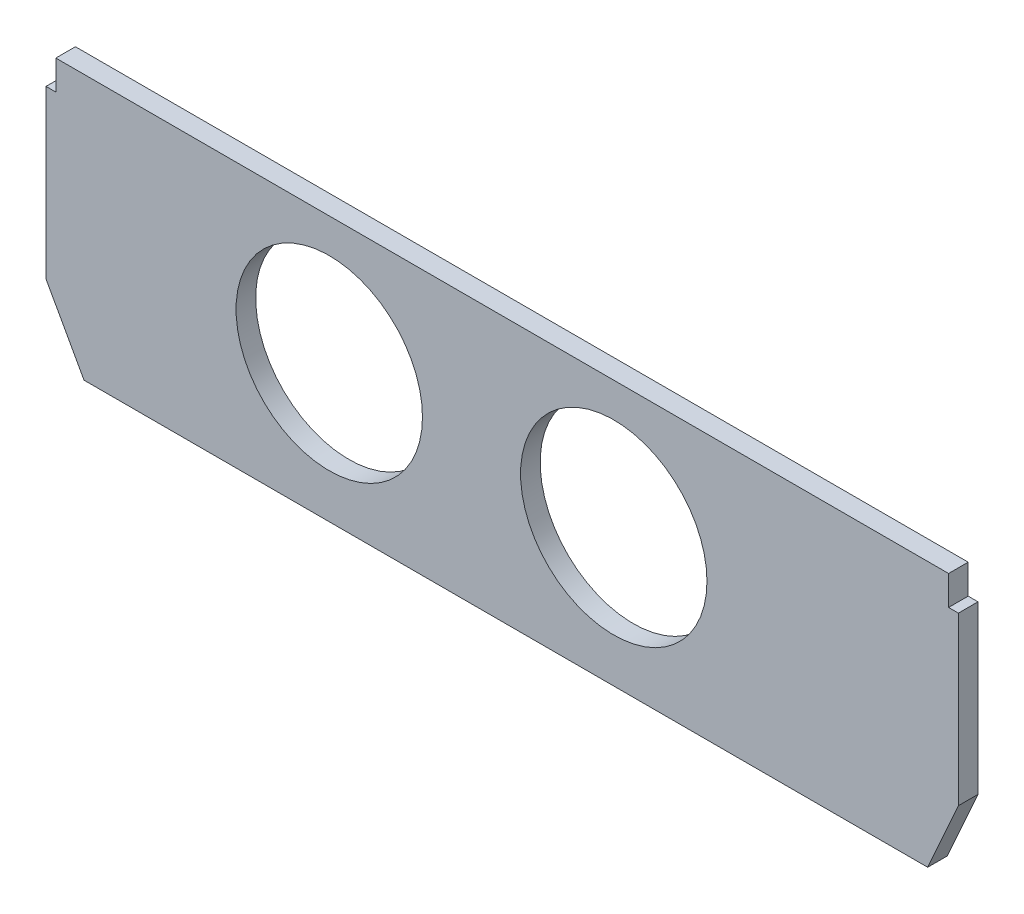
ISO-10303-21;
HEADER;
FILE_DESCRIPTION(('STEP AP214'),'2;1');
FILE_NAME('part.step','',(''),(''),'','','');
FILE_SCHEMA(('AUTOMOTIVE_DESIGN { 1 0 10303 214 1 1 1 1 }'));
ENDSEC;
DATA;
#1=APPLICATION_CONTEXT('core data for automotive mechanical design processes');
#2=APPLICATION_PROTOCOL_DEFINITION('international standard','automotive_design',2000,#1);
#3=PRODUCT_CONTEXT('',#1,'mechanical');
#4=PRODUCT('Part','Part','',(#3));
#5=PRODUCT_RELATED_PRODUCT_CATEGORY('part','',(#4));
#6=PRODUCT_DEFINITION_FORMATION('','',#4);
#7=PRODUCT_DEFINITION_CONTEXT('part definition',#1,'design');
#8=PRODUCT_DEFINITION('design','',#6,#7);
#9=PRODUCT_DEFINITION_SHAPE('','',#8);
#10=(LENGTH_UNIT() NAMED_UNIT(*) SI_UNIT(.MILLI.,.METRE.));
#11=(NAMED_UNIT(*) PLANE_ANGLE_UNIT() SI_UNIT($,.RADIAN.));
#12=(NAMED_UNIT(*) SI_UNIT($,.STERADIAN.) SOLID_ANGLE_UNIT());
#13=UNCERTAINTY_MEASURE_WITH_UNIT(LENGTH_MEASURE(1.E-05),#10,'distance_accuracy_value','');
#14=(GEOMETRIC_REPRESENTATION_CONTEXT(3) GLOBAL_UNCERTAINTY_ASSIGNED_CONTEXT((#13)) GLOBAL_UNIT_ASSIGNED_CONTEXT((#10,
#11,#12)) REPRESENTATION_CONTEXT('',''));
#15=CARTESIAN_POINT('',(0.,0.,0.));
#16=DIRECTION('',(0.,0.,1.));
#17=DIRECTION('',(1.,0.,0.));
#18=AXIS2_PLACEMENT_3D('',#15,#16,#17);
#19=CARTESIAN_POINT('',(10.635083268963,0.,10.));
#20=DIRECTION('',(-1.,0.,0.));
#21=DIRECTION('',(0.,-1.,0.));
#22=AXIS2_PLACEMENT_3D('',#19,#20,#21);
#23=PLANE('',#22);
#24=DIRECTION('',(0.,1.,0.));
#25=VECTOR('',#24,1.);
#26=CARTESIAN_POINT('',(10.635083268963,0.,0.));
#27=LINE('',#26,#25);
#28=CARTESIAN_POINT('',(10.635083268963,120.,0.));
#29=VERTEX_POINT('',#28);
#30=CARTESIAN_POINT('',(10.635083268963,135.,0.));
#31=VERTEX_POINT('',#30);
#32=EDGE_CURVE('E165',#29,#31,#27,.T.);
#33=ORIENTED_EDGE('',*,*,#32,.T.);
#34=DIRECTION('',(0.,0.,-1.));
#35=VECTOR('',#34,1.);
#36=CARTESIAN_POINT('',(10.635083268963,135.,10.));
#37=LINE('',#36,#35);
#38=CARTESIAN_POINT('',(10.635083268963,135.,10.));
#39=VERTEX_POINT('',#38);
#40=EDGE_CURVE('E11',#39,#31,#37,.T.);
#41=ORIENTED_EDGE('',*,*,#40,.F.);
#42=DIRECTION('',(0.,1.,0.));
#43=VECTOR('',#42,1.);
#44=CARTESIAN_POINT('',(10.635083268963,0.,10.));
#45=LINE('',#44,#43);
#46=CARTESIAN_POINT('',(10.635083268963,120.,10.));
#47=VERTEX_POINT('',#46);
#48=EDGE_CURVE('E207',#47,#39,#45,.T.);
#49=ORIENTED_EDGE('',*,*,#48,.F.);
#50=DIRECTION('',(0.,0.,-1.));
#51=VECTOR('',#50,1.);
#52=CARTESIAN_POINT('',(10.635083268963,120.,10.));
#53=LINE('',#52,#51);
#54=EDGE_CURVE('E164',#47,#29,#53,.T.);
#55=ORIENTED_EDGE('',*,*,#54,.T.);
#56=EDGE_LOOP('',(#33,#41,#49,#55));
#57=FACE_BOUND('',#56,.T.);
#58=ADVANCED_FACE('F43',(#57),#23,.F.);
#59=CARTESIAN_POINT('',(0.,135.,10.));
#60=DIRECTION('',(0.,-1.,0.));
#61=DIRECTION('',(1.,0.,0.));
#62=AXIS2_PLACEMENT_3D('',#59,#60,#61);
#63=PLANE('',#62);
#64=DIRECTION('',(-1.,0.,0.));
#65=VECTOR('',#64,1.);
#66=CARTESIAN_POINT('',(0.,135.,0.));
#67=LINE('',#66,#65);
#68=CARTESIAN_POINT('',(-444.364916731037,135.,0.));
#69=VERTEX_POINT('',#68);
#70=EDGE_CURVE('E169',#31,#69,#67,.T.);
#71=ORIENTED_EDGE('',*,*,#70,.T.);
#72=DIRECTION('',(0.,0.,-1.));
#73=VECTOR('',#72,1.);
#74=CARTESIAN_POINT('',(-444.364916731037,135.,10.));
#75=LINE('',#74,#73);
#76=CARTESIAN_POINT('',(-444.364916731037,135.,10.));
#77=VERTEX_POINT('',#76);
#78=EDGE_CURVE('E52',#77,#69,#75,.T.);
#79=ORIENTED_EDGE('',*,*,#78,.F.);
#80=DIRECTION('',(-1.,0.,0.));
#81=VECTOR('',#80,1.);
#82=CARTESIAN_POINT('',(0.,135.,10.));
#83=LINE('',#82,#81);
#84=EDGE_CURVE('E109',#39,#77,#83,.T.);
#85=ORIENTED_EDGE('',*,*,#84,.F.);
#86=ORIENTED_EDGE('',*,*,#40,.T.);
#87=EDGE_LOOP('',(#71,#79,#85,#86));
#88=FACE_BOUND('',#87,.T.);
#89=ADVANCED_FACE('F232',(#88),#63,.F.);
#90=CARTESIAN_POINT('',(-444.364916731037,0.,10.));
#91=DIRECTION('',(-1.,0.,0.));
#92=DIRECTION('',(0.,0.,1.));
#93=AXIS2_PLACEMENT_3D('',#90,#91,#92);
#94=PLANE('',#93);
#95=DIRECTION('',(0.,1.,0.));
#96=VECTOR('',#95,1.);
#97=CARTESIAN_POINT('',(-444.364916731037,0.,0.));
#98=LINE('',#97,#96);
#99=CARTESIAN_POINT('',(-444.364916731037,120.,0.));
#100=VERTEX_POINT('',#99);
#101=EDGE_CURVE('E173',#100,#69,#98,.T.);
#102=ORIENTED_EDGE('',*,*,#101,.F.);
#103=DIRECTION('',(0.,0.,-1.));
#104=VECTOR('',#103,1.);
#105=CARTESIAN_POINT('',(-444.364916731037,120.,10.));
#106=LINE('',#105,#104);
#107=CARTESIAN_POINT('',(-444.364916731037,120.,10.));
#108=VERTEX_POINT('',#107);
#109=EDGE_CURVE('E223',#108,#100,#106,.T.);
#110=ORIENTED_EDGE('',*,*,#109,.F.);
#111=DIRECTION('',(0.,1.,0.));
#112=VECTOR('',#111,1.);
#113=CARTESIAN_POINT('',(-444.364916731037,0.,10.));
#114=LINE('',#113,#112);
#115=EDGE_CURVE('E231',#108,#77,#114,.T.);
#116=ORIENTED_EDGE('',*,*,#115,.T.);
#117=ORIENTED_EDGE('',*,*,#78,.T.);
#118=EDGE_LOOP('',(#102,#110,#116,#117));
#119=FACE_BOUND('',#118,.T.);
#120=ADVANCED_FACE('F229',(#119),#94,.T.);
#121=CARTESIAN_POINT('',(0.,120.,10.));
#122=DIRECTION('',(0.,1.,0.));
#123=DIRECTION('',(0.,0.,1.));
#124=AXIS2_PLACEMENT_3D('',#121,#122,#123);
#125=PLANE('',#124);
#126=DIRECTION('',(1.,0.,0.));
#127=VECTOR('',#126,1.);
#128=CARTESIAN_POINT('',(0.,120.,0.));
#129=LINE('',#128,#127);
#130=CARTESIAN_POINT('',(-449.364916731037,120.,0.));
#131=VERTEX_POINT('',#130);
#132=EDGE_CURVE('E177',#131,#100,#129,.T.);
#133=ORIENTED_EDGE('',*,*,#132,.F.);
#134=DIRECTION('',(0.,0.,-1.));
#135=VECTOR('',#134,1.);
#136=CARTESIAN_POINT('',(-449.364916731037,120.,10.));
#137=LINE('',#136,#135);
#138=CARTESIAN_POINT('',(-449.364916731037,120.,10.));
#139=VERTEX_POINT('',#138);
#140=EDGE_CURVE('E220',#139,#131,#137,.T.);
#141=ORIENTED_EDGE('',*,*,#140,.F.);
#142=DIRECTION('',(1.,0.,0.));
#143=VECTOR('',#142,1.);
#144=CARTESIAN_POINT('',(0.,120.,10.));
#145=LINE('',#144,#143);
#146=EDGE_CURVE('E244',#139,#108,#145,.T.);
#147=ORIENTED_EDGE('',*,*,#146,.T.);
#148=ORIENTED_EDGE('',*,*,#109,.T.);
#149=EDGE_LOOP('',(#133,#141,#147,#148));
#150=FACE_BOUND('',#149,.T.);
#151=ADVANCED_FACE('F241',(#150),#125,.T.);
#152=CARTESIAN_POINT('',(-449.364916731037,0.,10.));
#153=DIRECTION('',(-1.,0.,0.));
#154=DIRECTION('',(0.,0.,1.));
#155=AXIS2_PLACEMENT_3D('',#152,#153,#154);
#156=PLANE('',#155);
#157=DIRECTION('',(0.,1.,0.));
#158=VECTOR('',#157,1.);
#159=CARTESIAN_POINT('',(-449.364916731037,0.,0.));
#160=LINE('',#159,#158);
#161=CARTESIAN_POINT('',(-449.364916731037,35.,0.));
#162=VERTEX_POINT('',#161);
#163=EDGE_CURVE('E181',#162,#131,#160,.T.);
#164=ORIENTED_EDGE('',*,*,#163,.F.);
#165=DIRECTION('',(0.,0.,-1.));
#166=VECTOR('',#165,1.);
#167=CARTESIAN_POINT('',(-449.364916731037,35.,10.));
#168=LINE('',#167,#166);
#169=CARTESIAN_POINT('',(-449.364916731037,35.,10.));
#170=VERTEX_POINT('',#169);
#171=EDGE_CURVE('E217',#170,#162,#168,.T.);
#172=ORIENTED_EDGE('',*,*,#171,.F.);
#173=DIRECTION('',(0.,1.,0.));
#174=VECTOR('',#173,1.);
#175=CARTESIAN_POINT('',(-449.364916731037,0.,10.));
#176=LINE('',#175,#174);
#177=EDGE_CURVE('E251',#170,#139,#176,.T.);
#178=ORIENTED_EDGE('',*,*,#177,.T.);
#179=ORIENTED_EDGE('',*,*,#140,.T.);
#180=EDGE_LOOP('',(#164,#172,#178,#179));
#181=FACE_BOUND('',#180,.T.);
#182=ADVANCED_FACE('F293',(#181),#156,.T.);
#183=CARTESIAN_POINT('',(-329.21875,-182.151248001318,10.));
#184=DIRECTION('',(-0.875,-0.484122918275928,0.));
#185=DIRECTION('',(0.484122918275928,-0.875,0.));
#186=AXIS2_PLACEMENT_3D('',#183,#184,#185);
#187=PLANE('',#186);
#188=DIRECTION('',(-0.484122918275928,0.875,0.));
#189=VECTOR('',#188,1.);
#190=CARTESIAN_POINT('',(-329.21875,-182.151248001318,0.));
#191=LINE('',#190,#189);
#192=CARTESIAN_POINT('',(-430.,0.,0.));
#193=VERTEX_POINT('',#192);
#194=EDGE_CURVE('E185',#193,#162,#191,.T.);
#195=ORIENTED_EDGE('',*,*,#194,.F.);
#196=DIRECTION('',(0.,0.,-1.));
#197=VECTOR('',#196,1.);
#198=CARTESIAN_POINT('',(-430.,0.,10.));
#199=LINE('',#198,#197);
#200=CARTESIAN_POINT('',(-430.,0.,10.));
#201=VERTEX_POINT('',#200);
#202=EDGE_CURVE('E214',#201,#193,#199,.T.);
#203=ORIENTED_EDGE('',*,*,#202,.F.);
#204=DIRECTION('',(-0.484122918275928,0.875,0.));
#205=VECTOR('',#204,1.);
#206=CARTESIAN_POINT('',(-329.21875,-182.151248001318,10.));
#207=LINE('',#206,#205);
#208=EDGE_CURVE('E258',#201,#170,#207,.T.);
#209=ORIENTED_EDGE('',*,*,#208,.T.);
#210=ORIENTED_EDGE('',*,*,#171,.T.);
#211=EDGE_LOOP('',(#195,#203,#209,#210));
#212=FACE_BOUND('',#211,.T.);
#213=ADVANCED_FACE('F296',(#212),#187,.T.);
#214=CARTESIAN_POINT('',(0.,0.,10.));
#215=DIRECTION('',(0.,-1.,0.));
#216=DIRECTION('',(0.,0.,-1.));
#217=AXIS2_PLACEMENT_3D('',#214,#215,#216);
#218=PLANE('',#217);
#219=DIRECTION('',(-1.,0.,0.));
#220=VECTOR('',#219,1.);
#221=CARTESIAN_POINT('',(0.,0.,0.));
#222=LINE('',#221,#220);
#223=CARTESIAN_POINT('',(0.,0.,0.));
#224=VERTEX_POINT('',#223);
#225=EDGE_CURVE('E189',#224,#193,#222,.T.);
#226=ORIENTED_EDGE('',*,*,#225,.F.);
#227=DIRECTION('',(0.,0.,-1.));
#228=VECTOR('',#227,1.);
#229=CARTESIAN_POINT('',(0.,0.,10.));
#230=LINE('',#229,#228);
#231=CARTESIAN_POINT('',(0.,0.,10.));
#232=VERTEX_POINT('',#231);
#233=EDGE_CURVE('E146',#232,#224,#230,.T.);
#234=ORIENTED_EDGE('',*,*,#233,.F.);
#235=DIRECTION('',(-1.,0.,0.));
#236=VECTOR('',#235,1.);
#237=CARTESIAN_POINT('',(0.,0.,10.));
#238=LINE('',#237,#236);
#239=EDGE_CURVE('E137',#232,#201,#238,.T.);
#240=ORIENTED_EDGE('',*,*,#239,.T.);
#241=ORIENTED_EDGE('',*,*,#202,.T.);
#242=EDGE_LOOP('',(#226,#234,#240,#241));
#243=FACE_BOUND('',#242,.T.);
#244=ADVANCED_FACE('F264',(#243),#218,.T.);
#245=CARTESIAN_POINT('',(0.,0.,10.));
#246=DIRECTION('',(-0.91303994142208,0.40787015748638,0.));
#247=DIRECTION('',(-0.40787015748638,-0.91303994142208,0.));
#248=AXIS2_PLACEMENT_3D('',#245,#246,#247);
#249=PLANE('',#248);
#250=DIRECTION('',(0.40787015748638,0.91303994142208,0.));
#251=VECTOR('',#250,1.);
#252=CARTESIAN_POINT('',(0.,0.,0.));
#253=LINE('',#252,#251);
#254=CARTESIAN_POINT('',(15.635083268963,35.,0.));
#255=VERTEX_POINT('',#254);
#256=EDGE_CURVE('E144',#224,#255,#253,.T.);
#257=ORIENTED_EDGE('',*,*,#256,.T.);
#258=DIRECTION('',(0.,0.,-1.));
#259=VECTOR('',#258,1.);
#260=CARTESIAN_POINT('',(15.635083268963,35.,10.));
#261=LINE('',#260,#259);
#262=CARTESIAN_POINT('',(15.635083268963,35.,10.));
#263=VERTEX_POINT('',#262);
#264=EDGE_CURVE('E141',#263,#255,#261,.T.);
#265=ORIENTED_EDGE('',*,*,#264,.F.);
#266=DIRECTION('',(0.40787015748638,0.91303994142208,0.));
#267=VECTOR('',#266,1.);
#268=CARTESIAN_POINT('',(0.,0.,10.));
#269=LINE('',#268,#267);
#270=EDGE_CURVE('E129',#232,#263,#269,.T.);
#271=ORIENTED_EDGE('',*,*,#270,.F.);
#272=ORIENTED_EDGE('',*,*,#233,.T.);
#273=EDGE_LOOP('',(#257,#265,#271,#272));
#274=FACE_BOUND('',#273,.T.);
#275=ADVANCED_FACE('F142',(#274),#249,.F.);
#276=CARTESIAN_POINT('',(15.635083268963,0.,10.));
#277=DIRECTION('',(-1.,0.,0.));
#278=DIRECTION('',(0.,0.,1.));
#279=AXIS2_PLACEMENT_3D('',#276,#277,#278);
#280=PLANE('',#279);
#281=DIRECTION('',(0.,1.,0.));
#282=VECTOR('',#281,1.);
#283=CARTESIAN_POINT('',(15.635083268963,0.,0.));
#284=LINE('',#283,#282);
#285=CARTESIAN_POINT('',(15.635083268963,120.,0.));
#286=VERTEX_POINT('',#285);
#287=EDGE_CURVE('E95',#255,#286,#284,.T.);
#288=ORIENTED_EDGE('',*,*,#287,.T.);
#289=DIRECTION('',(0.,0.,-1.));
#290=VECTOR('',#289,1.);
#291=CARTESIAN_POINT('',(15.635083268963,120.,10.));
#292=LINE('',#291,#290);
#293=CARTESIAN_POINT('',(15.635083268963,120.,10.));
#294=VERTEX_POINT('',#293);
#295=EDGE_CURVE('E147',#294,#286,#292,.T.);
#296=ORIENTED_EDGE('',*,*,#295,.F.);
#297=DIRECTION('',(0.,1.,0.));
#298=VECTOR('',#297,1.);
#299=CARTESIAN_POINT('',(15.635083268963,0.,10.));
#300=LINE('',#299,#298);
#301=EDGE_CURVE('E134',#263,#294,#300,.T.);
#302=ORIENTED_EDGE('',*,*,#301,.F.);
#303=ORIENTED_EDGE('',*,*,#264,.T.);
#304=EDGE_LOOP('',(#288,#296,#302,#303));
#305=FACE_BOUND('',#304,.T.);
#306=ADVANCED_FACE('F149',(#305),#280,.F.);
#307=CARTESIAN_POINT('',(-305.,70.,10.));
#308=DIRECTION('',(0.,0.,-1.));
#309=DIRECTION('',(-1.,0.,0.));
#310=AXIS2_PLACEMENT_3D('',#307,#308,#309);
#311=CYLINDRICAL_SURFACE('',#310,47.5);
#312=CARTESIAN_POINT('',(-305.,70.,10.));
#313=DIRECTION('',(0.,0.,1.));
#314=DIRECTION('',(1.,0.,0.));
#315=AXIS2_PLACEMENT_3D('',#312,#313,#314);
#316=CIRCLE('',#315,47.5);
#317=CARTESIAN_POINT('',(-257.5,70.,10.));
#318=VERTEX_POINT('',#317);
#319=EDGE_CURVE('E153',#318,#318,#316,.T.);
#320=ORIENTED_EDGE('',*,*,#319,.T.);
#321=EDGE_LOOP('',(#320));
#322=FACE_BOUND('',#321,.T.);
#323=CARTESIAN_POINT('',(-305.,70.,0.));
#324=DIRECTION('',(0.,0.,1.));
#325=DIRECTION('',(1.,0.,0.));
#326=AXIS2_PLACEMENT_3D('',#323,#324,#325);
#327=CIRCLE('',#326,47.5);
#328=CARTESIAN_POINT('',(-257.5,70.,0.));
#329=VERTEX_POINT('',#328);
#330=EDGE_CURVE('E199',#329,#329,#327,.T.);
#331=ORIENTED_EDGE('',*,*,#330,.F.);
#332=EDGE_LOOP('',(#331));
#333=FACE_BOUND('',#332,.T.);
#334=ADVANCED_FACE('F271',(#322,#333),#311,.F.);
#335=CARTESIAN_POINT('',(-3.33066907387546E-13,120.,10.));
#336=DIRECTION('',(0.,-1.,0.));
#337=DIRECTION('',(1.,0.,0.));
#338=AXIS2_PLACEMENT_3D('',#335,#336,#337);
#339=PLANE('',#338);
#340=DIRECTION('',(-1.,0.,0.));
#341=VECTOR('',#340,1.);
#342=CARTESIAN_POINT('',(-3.33066907387546E-13,120.,0.));
#343=LINE('',#342,#341);
#344=EDGE_CURVE('E101',#286,#29,#343,.T.);
#345=ORIENTED_EDGE('',*,*,#344,.T.);
#346=ORIENTED_EDGE('',*,*,#54,.F.);
#347=DIRECTION('',(-1.,0.,0.));
#348=VECTOR('',#347,1.);
#349=CARTESIAN_POINT('',(-3.33066907387546E-13,120.,10.));
#350=LINE('',#349,#348);
#351=EDGE_CURVE('E60',#294,#47,#350,.T.);
#352=ORIENTED_EDGE('',*,*,#351,.F.);
#353=ORIENTED_EDGE('',*,*,#295,.T.);
#354=EDGE_LOOP('',(#345,#346,#352,#353));
#355=FACE_BOUND('',#354,.T.);
#356=ADVANCED_FACE('F268',(#355),#339,.F.);
#357=CARTESIAN_POINT('',(-160.,70.,10.));
#358=DIRECTION('',(0.,0.,-1.));
#359=DIRECTION('',(-1.,0.,0.));
#360=AXIS2_PLACEMENT_3D('',#357,#358,#359);
#361=CYLINDRICAL_SURFACE('',#360,47.5);
#362=CARTESIAN_POINT('',(-160.,70.,10.));
#363=DIRECTION('',(0.,0.,1.));
#364=DIRECTION('',(1.,0.,0.));
#365=AXIS2_PLACEMENT_3D('',#362,#363,#364);
#366=CIRCLE('',#365,47.5);
#367=CARTESIAN_POINT('',(-112.5,70.,10.));
#368=VERTEX_POINT('',#367);
#369=EDGE_CURVE('E160',#368,#368,#366,.T.);
#370=ORIENTED_EDGE('',*,*,#369,.T.);
#371=EDGE_LOOP('',(#370));
#372=FACE_BOUND('',#371,.T.);
#373=CARTESIAN_POINT('',(-160.,70.,0.));
#374=DIRECTION('',(0.,0.,1.));
#375=DIRECTION('',(1.,0.,0.));
#376=AXIS2_PLACEMENT_3D('',#373,#374,#375);
#377=CIRCLE('',#376,47.5);
#378=CARTESIAN_POINT('',(-112.5,70.,0.));
#379=VERTEX_POINT('',#378);
#380=EDGE_CURVE('E203',#379,#379,#377,.T.);
#381=ORIENTED_EDGE('',*,*,#380,.F.);
#382=EDGE_LOOP('',(#381));
#383=FACE_BOUND('',#382,.T.);
#384=ADVANCED_FACE('F270',(#372,#383),#361,.F.);
#385=CARTESIAN_POINT('',(0.,0.,10.));
#386=DIRECTION('',(0.,0.,1.));
#387=DIRECTION('',(1.,0.,0.));
#388=AXIS2_PLACEMENT_3D('',#385,#386,#387);
#389=PLANE('',#388);
#390=ORIENTED_EDGE('',*,*,#48,.T.);
#391=ORIENTED_EDGE('',*,*,#84,.T.);
#392=ORIENTED_EDGE('',*,*,#115,.F.);
#393=ORIENTED_EDGE('',*,*,#146,.F.);
#394=ORIENTED_EDGE('',*,*,#177,.F.);
#395=ORIENTED_EDGE('',*,*,#208,.F.);
#396=ORIENTED_EDGE('',*,*,#239,.F.);
#397=ORIENTED_EDGE('',*,*,#270,.T.);
#398=ORIENTED_EDGE('',*,*,#301,.T.);
#399=ORIENTED_EDGE('',*,*,#351,.T.);
#400=EDGE_LOOP('',(#390,#391,#392,#393,#394,#395,#396,#397,#398,#399));
#401=FACE_BOUND('',#400,.T.);
#402=ORIENTED_EDGE('',*,*,#319,.F.);
#403=EDGE_LOOP('',(#402));
#404=FACE_BOUND('',#403,.T.);
#405=ORIENTED_EDGE('',*,*,#369,.F.);
#406=EDGE_LOOP('',(#405));
#407=FACE_BOUND('',#406,.T.);
#408=ADVANCED_FACE('F131',(#401,#404,#407),#389,.T.);
#409=CARTESIAN_POINT('',(0.,0.,0.));
#410=DIRECTION('',(0.,0.,1.));
#411=DIRECTION('',(1.,0.,0.));
#412=AXIS2_PLACEMENT_3D('',#409,#410,#411);
#413=PLANE('',#412);
#414=ORIENTED_EDGE('',*,*,#32,.F.);
#415=ORIENTED_EDGE('',*,*,#344,.F.);
#416=ORIENTED_EDGE('',*,*,#287,.F.);
#417=ORIENTED_EDGE('',*,*,#256,.F.);
#418=ORIENTED_EDGE('',*,*,#225,.T.);
#419=ORIENTED_EDGE('',*,*,#194,.T.);
#420=ORIENTED_EDGE('',*,*,#163,.T.);
#421=ORIENTED_EDGE('',*,*,#132,.T.);
#422=ORIENTED_EDGE('',*,*,#101,.T.);
#423=ORIENTED_EDGE('',*,*,#70,.F.);
#424=EDGE_LOOP('',(#414,#415,#416,#417,#418,#419,#420,#421,#422,#423));
#425=FACE_BOUND('',#424,.T.);
#426=ORIENTED_EDGE('',*,*,#330,.T.);
#427=EDGE_LOOP('',(#426));
#428=FACE_BOUND('',#427,.T.);
#429=ORIENTED_EDGE('',*,*,#380,.T.);
#430=EDGE_LOOP('',(#429));
#431=FACE_BOUND('',#430,.T.);
#432=ADVANCED_FACE('F236',(#425,#428,#431),#413,.F.);
#433=CLOSED_SHELL('',(#58,#89,#120,#151,#182,#213,#244,#275,#306,#334,#356,#384,#408,#432));
#434=MANIFOLD_SOLID_BREP('B2',#433);
#435=ADVANCED_BREP_SHAPE_REPRESENTATION('',(#18,#434),#14);
#436=SHAPE_DEFINITION_REPRESENTATION(#9,#435);
ENDSEC;
END-ISO-10303-21;
